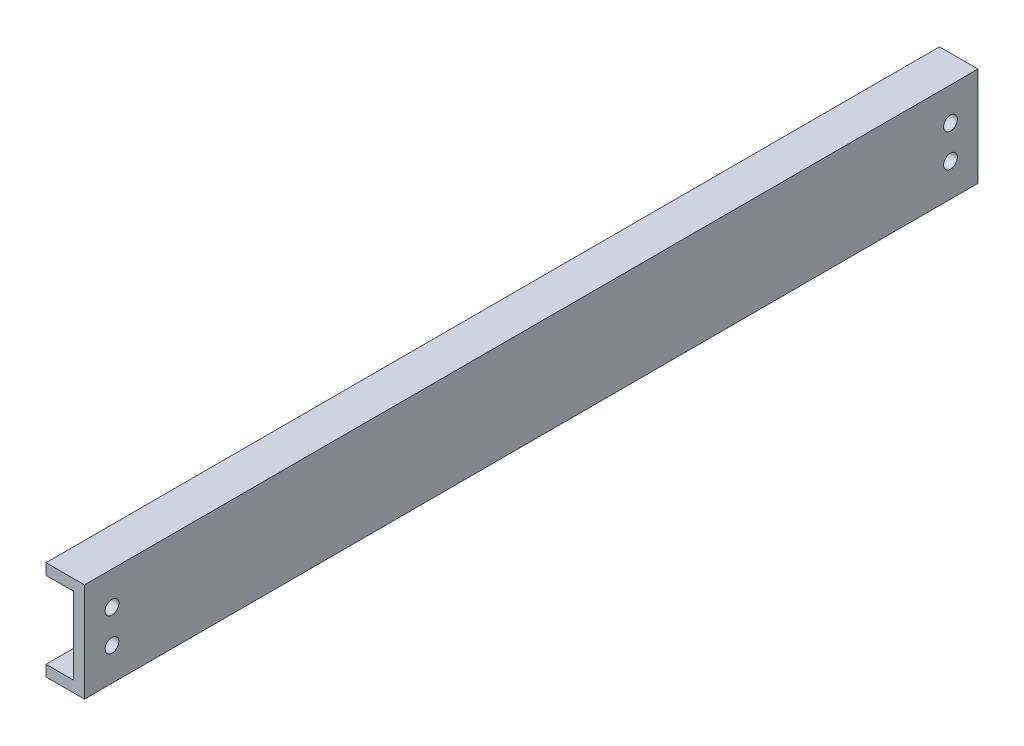
ISO-10303-21;
HEADER;
FILE_DESCRIPTION(('STEP AP214'),'2;1');
FILE_NAME('part.step','',(''),(''),'','','');
FILE_SCHEMA(('AUTOMOTIVE_DESIGN { 1 0 10303 214 1 1 1 1 }'));
ENDSEC;
DATA;
#1=APPLICATION_CONTEXT('core data for automotive mechanical design processes');
#2=APPLICATION_PROTOCOL_DEFINITION('international standard','automotive_design',2000,#1);
#3=PRODUCT_CONTEXT('',#1,'mechanical');
#4=PRODUCT('Part','Part','',(#3));
#5=PRODUCT_RELATED_PRODUCT_CATEGORY('part','',(#4));
#6=PRODUCT_DEFINITION_FORMATION('','',#4);
#7=PRODUCT_DEFINITION_CONTEXT('part definition',#1,'design');
#8=PRODUCT_DEFINITION('design','',#6,#7);
#9=PRODUCT_DEFINITION_SHAPE('','',#8);
#10=(LENGTH_UNIT() NAMED_UNIT(*) SI_UNIT(.MILLI.,.METRE.));
#11=(NAMED_UNIT(*) PLANE_ANGLE_UNIT() SI_UNIT($,.RADIAN.));
#12=(NAMED_UNIT(*) SI_UNIT($,.STERADIAN.) SOLID_ANGLE_UNIT());
#13=UNCERTAINTY_MEASURE_WITH_UNIT(LENGTH_MEASURE(1.E-05),#10,'distance_accuracy_value','');
#14=(GEOMETRIC_REPRESENTATION_CONTEXT(3) GLOBAL_UNCERTAINTY_ASSIGNED_CONTEXT((#13)) GLOBAL_UNIT_ASSIGNED_CONTEXT((#10,
#11,#12)) REPRESENTATION_CONTEXT('',''));
#15=CARTESIAN_POINT('',(0.,0.,0.));
#16=DIRECTION('',(0.,0.,1.));
#17=DIRECTION('',(1.,0.,0.));
#18=AXIS2_PLACEMENT_3D('',#15,#16,#17);
#19=CARTESIAN_POINT('',(-7.,9.88828278471343,-162.5));
#20=DIRECTION('',(-1.,0.,0.));
#21=DIRECTION('',(0.,0.,1.));
#22=AXIS2_PLACEMENT_3D('',#19,#20,#21);
#23=PLANE('',#22);
#24=DIRECTION('',(0.,-1.,0.));
#25=VECTOR('',#24,1.);
#26=CARTESIAN_POINT('',(-7.,9.88828278471343,0.));
#27=LINE('',#26,#25);
#28=CARTESIAN_POINT('',(-7.,9.88828278471343,0.));
#29=VERTEX_POINT('',#28);
#30=CARTESIAN_POINT('',(-7.,7.88828278471343,0.));
#31=VERTEX_POINT('',#30);
#32=EDGE_CURVE('E135',#29,#31,#27,.T.);
#33=ORIENTED_EDGE('',*,*,#32,.F.);
#34=DIRECTION('',(0.,0.,1.));
#35=VECTOR('',#34,1.);
#36=CARTESIAN_POINT('',(-7.,9.88828278471343,-162.5));
#37=LINE('',#36,#35);
#38=CARTESIAN_POINT('',(-7.,9.88828278471343,-162.5));
#39=VERTEX_POINT('',#38);
#40=EDGE_CURVE('E11',#39,#29,#37,.T.);
#41=ORIENTED_EDGE('',*,*,#40,.F.);
#42=DIRECTION('',(0.,-1.,0.));
#43=VECTOR('',#42,1.);
#44=CARTESIAN_POINT('',(-7.,9.88828278471343,-162.5));
#45=LINE('',#44,#43);
#46=CARTESIAN_POINT('',(-7.,7.88828278471343,-162.5));
#47=VERTEX_POINT('',#46);
#48=EDGE_CURVE('E155',#39,#47,#45,.T.);
#49=ORIENTED_EDGE('',*,*,#48,.T.);
#50=DIRECTION('',(0.,0.,1.));
#51=VECTOR('',#50,1.);
#52=CARTESIAN_POINT('',(-7.,7.88828278471343,-162.5));
#53=LINE('',#52,#51);
#54=EDGE_CURVE('E93',#47,#31,#53,.T.);
#55=ORIENTED_EDGE('',*,*,#54,.T.);
#56=EDGE_LOOP('',(#33,#41,#49,#55));
#57=FACE_BOUND('',#56,.T.);
#58=ADVANCED_FACE('F37',(#57),#23,.T.);
#59=CARTESIAN_POINT('',(-7.,9.88828278471343,-162.5));
#60=DIRECTION('',(0.,1.,0.));
#61=DIRECTION('',(-1.,0.,0.));
#62=AXIS2_PLACEMENT_3D('',#59,#60,#61);
#63=PLANE('',#62);
#64=DIRECTION('',(-1.,0.,0.));
#65=VECTOR('',#64,1.);
#66=CARTESIAN_POINT('',(-7.,9.88828278471343,0.));
#67=LINE('',#66,#65);
#68=CARTESIAN_POINT('',(0.,9.88828278471343,0.));
#69=VERTEX_POINT('',#68);
#70=EDGE_CURVE('E153',#69,#29,#67,.T.);
#71=ORIENTED_EDGE('',*,*,#70,.F.);
#72=DIRECTION('',(0.,0.,1.));
#73=VECTOR('',#72,1.);
#74=CARTESIAN_POINT('',(0.,9.88828278471343,-162.5));
#75=LINE('',#74,#73);
#76=CARTESIAN_POINT('',(0.,9.88828278471343,-162.5));
#77=VERTEX_POINT('',#76);
#78=EDGE_CURVE('E46',#77,#69,#75,.T.);
#79=ORIENTED_EDGE('',*,*,#78,.F.);
#80=DIRECTION('',(-1.,0.,0.));
#81=VECTOR('',#80,1.);
#82=CARTESIAN_POINT('',(-7.,9.88828278471343,-162.5));
#83=LINE('',#82,#81);
#84=EDGE_CURVE('E125',#77,#39,#83,.T.);
#85=ORIENTED_EDGE('',*,*,#84,.T.);
#86=ORIENTED_EDGE('',*,*,#40,.T.);
#87=EDGE_LOOP('',(#71,#79,#85,#86));
#88=FACE_BOUND('',#87,.T.);
#89=ADVANCED_FACE('F211',(#88),#63,.T.);
#90=CARTESIAN_POINT('',(0.,9.88828278471343,-162.5));
#91=DIRECTION('',(1.,0.,0.));
#92=DIRECTION('',(0.,1.,0.));
#93=AXIS2_PLACEMENT_3D('',#90,#91,#92);
#94=PLANE('',#93);
#95=CARTESIAN_POINT('',(0.,3.88828278471345,-157.5));
#96=DIRECTION('',(1.,0.,0.));
#97=DIRECTION('',(0.,-1.,0.));
#98=AXIS2_PLACEMENT_3D('',#95,#96,#97);
#99=CIRCLE('',#98,1.25000000000004);
#100=CARTESIAN_POINT('',(0.,2.63828278471341,-157.5));
#101=VERTEX_POINT('',#100);
#102=EDGE_CURVE('E259',#101,#101,#99,.T.);
#103=ORIENTED_EDGE('',*,*,#102,.F.);
#104=EDGE_LOOP('',(#103));
#105=FACE_BOUND('',#104,.T.);
#106=CARTESIAN_POINT('',(0.,-2.11171721528655,-157.5));
#107=DIRECTION('',(1.,0.,0.));
#108=DIRECTION('',(0.,1.,0.));
#109=AXIS2_PLACEMENT_3D('',#106,#107,#108);
#110=CIRCLE('',#109,1.25000000000004);
#111=CARTESIAN_POINT('',(0.,-0.861717215286511,-157.5));
#112=VERTEX_POINT('',#111);
#113=EDGE_CURVE('E255',#112,#112,#110,.T.);
#114=ORIENTED_EDGE('',*,*,#113,.F.);
#115=EDGE_LOOP('',(#114));
#116=FACE_BOUND('',#115,.T.);
#117=CARTESIAN_POINT('',(0.,-2.11171721528657,-5.));
#118=DIRECTION('',(1.,0.,0.));
#119=DIRECTION('',(0.,-1.,0.));
#120=AXIS2_PLACEMENT_3D('',#117,#118,#119);
#121=CIRCLE('',#120,1.25);
#122=CARTESIAN_POINT('',(0.,-3.36171721528657,-5.));
#123=VERTEX_POINT('',#122);
#124=EDGE_CURVE('E253',#123,#123,#121,.T.);
#125=ORIENTED_EDGE('',*,*,#124,.F.);
#126=EDGE_LOOP('',(#125));
#127=FACE_BOUND('',#126,.T.);
#128=CARTESIAN_POINT('',(0.,3.88828278471343,-5.));
#129=DIRECTION('',(1.,0.,0.));
#130=DIRECTION('',(0.,1.,0.));
#131=AXIS2_PLACEMENT_3D('',#128,#129,#130);
#132=CIRCLE('',#131,1.25);
#133=CARTESIAN_POINT('',(0.,5.13828278471343,-5.));
#134=VERTEX_POINT('',#133);
#135=EDGE_CURVE('E170',#134,#134,#132,.T.);
#136=ORIENTED_EDGE('',*,*,#135,.F.);
#137=EDGE_LOOP('',(#136));
#138=FACE_BOUND('',#137,.T.);
#139=DIRECTION('',(0.,1.,0.));
#140=VECTOR('',#139,1.);
#141=CARTESIAN_POINT('',(0.,9.88828278471343,0.));
#142=LINE('',#141,#140);
#143=CARTESIAN_POINT('',(0.,-8.11171721528657,0.));
#144=VERTEX_POINT('',#143);
#145=EDGE_CURVE('E112',#144,#69,#142,.T.);
#146=ORIENTED_EDGE('',*,*,#145,.F.);
#147=DIRECTION('',(0.,0.,1.));
#148=VECTOR('',#147,1.);
#149=CARTESIAN_POINT('',(0.,-8.11171721528657,-162.5));
#150=LINE('',#149,#148);
#151=CARTESIAN_POINT('',(0.,-8.11171721528657,-162.5));
#152=VERTEX_POINT('',#151);
#153=EDGE_CURVE('E107',#152,#144,#150,.T.);
#154=ORIENTED_EDGE('',*,*,#153,.F.);
#155=DIRECTION('',(0.,1.,0.));
#156=VECTOR('',#155,1.);
#157=CARTESIAN_POINT('',(0.,9.88828278471343,-162.5));
#158=LINE('',#157,#156);
#159=EDGE_CURVE('E110',#152,#77,#158,.T.);
#160=ORIENTED_EDGE('',*,*,#159,.T.);
#161=ORIENTED_EDGE('',*,*,#78,.T.);
#162=EDGE_LOOP('',(#146,#154,#160,#161));
#163=FACE_BOUND('',#162,.T.);
#164=ADVANCED_FACE('F109',(#105,#116,#127,#138,#163),#94,.T.);
#165=CARTESIAN_POINT('',(0.,-8.11171721528657,-162.5));
#166=DIRECTION('',(0.,-1.,0.));
#167=DIRECTION('',(1.,0.,0.));
#168=AXIS2_PLACEMENT_3D('',#165,#166,#167);
#169=PLANE('',#168);
#170=DIRECTION('',(1.,0.,0.));
#171=VECTOR('',#170,1.);
#172=CARTESIAN_POINT('',(0.,-8.11171721528657,0.));
#173=LINE('',#172,#171);
#174=CARTESIAN_POINT('',(-7.,-8.11171721528657,0.));
#175=VERTEX_POINT('',#174);
#176=EDGE_CURVE('E150',#175,#144,#173,.T.);
#177=ORIENTED_EDGE('',*,*,#176,.F.);
#178=DIRECTION('',(0.,0.,1.));
#179=VECTOR('',#178,1.);
#180=CARTESIAN_POINT('',(-7.,-8.11171721528657,-162.5));
#181=LINE('',#180,#179);
#182=CARTESIAN_POINT('',(-7.,-8.11171721528657,-162.5));
#183=VERTEX_POINT('',#182);
#184=EDGE_CURVE('E117',#183,#175,#181,.T.);
#185=ORIENTED_EDGE('',*,*,#184,.F.);
#186=DIRECTION('',(1.,0.,0.));
#187=VECTOR('',#186,1.);
#188=CARTESIAN_POINT('',(0.,-8.11171721528657,-162.5));
#189=LINE('',#188,#187);
#190=EDGE_CURVE('E123',#183,#152,#189,.T.);
#191=ORIENTED_EDGE('',*,*,#190,.T.);
#192=ORIENTED_EDGE('',*,*,#153,.T.);
#193=EDGE_LOOP('',(#177,#185,#191,#192));
#194=FACE_BOUND('',#193,.T.);
#195=ADVANCED_FACE('F127',(#194),#169,.T.);
#196=CARTESIAN_POINT('',(-7.,-8.11171721528657,-162.5));
#197=DIRECTION('',(-1.,0.,0.));
#198=DIRECTION('',(0.,0.,1.));
#199=AXIS2_PLACEMENT_3D('',#196,#197,#198);
#200=PLANE('',#199);
#201=DIRECTION('',(0.,-1.,0.));
#202=VECTOR('',#201,1.);
#203=CARTESIAN_POINT('',(-7.,-8.11171721528657,0.));
#204=LINE('',#203,#202);
#205=CARTESIAN_POINT('',(-7.,-6.11171721528657,0.));
#206=VERTEX_POINT('',#205);
#207=EDGE_CURVE('E147',#206,#175,#204,.T.);
#208=ORIENTED_EDGE('',*,*,#207,.F.);
#209=DIRECTION('',(0.,0.,1.));
#210=VECTOR('',#209,1.);
#211=CARTESIAN_POINT('',(-7.,-6.11171721528657,-162.5));
#212=LINE('',#211,#210);
#213=CARTESIAN_POINT('',(-7.,-6.11171721528657,-162.5));
#214=VERTEX_POINT('',#213);
#215=EDGE_CURVE('E159',#214,#206,#212,.T.);
#216=ORIENTED_EDGE('',*,*,#215,.F.);
#217=DIRECTION('',(0.,-1.,0.));
#218=VECTOR('',#217,1.);
#219=CARTESIAN_POINT('',(-7.,-8.11171721528657,-162.5));
#220=LINE('',#219,#218);
#221=EDGE_CURVE('E128',#214,#183,#220,.T.);
#222=ORIENTED_EDGE('',*,*,#221,.T.);
#223=ORIENTED_EDGE('',*,*,#184,.T.);
#224=EDGE_LOOP('',(#208,#216,#222,#223));
#225=FACE_BOUND('',#224,.T.);
#226=ADVANCED_FACE('F210',(#225),#200,.T.);
#227=CARTESIAN_POINT('',(-2.,-6.11171721528657,-162.5));
#228=DIRECTION('',(0.,1.,0.));
#229=DIRECTION('',(0.,0.,1.));
#230=AXIS2_PLACEMENT_3D('',#227,#228,#229);
#231=PLANE('',#230);
#232=DIRECTION('',(-1.,0.,0.));
#233=VECTOR('',#232,1.);
#234=CARTESIAN_POINT('',(-2.,-6.11171721528657,0.));
#235=LINE('',#234,#233);
#236=CARTESIAN_POINT('',(-2.,-6.11171721528657,0.));
#237=VERTEX_POINT('',#236);
#238=EDGE_CURVE('E144',#237,#206,#235,.T.);
#239=ORIENTED_EDGE('',*,*,#238,.F.);
#240=DIRECTION('',(0.,0.,1.));
#241=VECTOR('',#240,1.);
#242=CARTESIAN_POINT('',(-2.,-6.11171721528657,-162.5));
#243=LINE('',#242,#241);
#244=CARTESIAN_POINT('',(-2.,-6.11171721528657,-162.5));
#245=VERTEX_POINT('',#244);
#246=EDGE_CURVE('E161',#245,#237,#243,.T.);
#247=ORIENTED_EDGE('',*,*,#246,.F.);
#248=DIRECTION('',(-1.,0.,0.));
#249=VECTOR('',#248,1.);
#250=CARTESIAN_POINT('',(-2.,-6.11171721528657,-162.5));
#251=LINE('',#250,#249);
#252=EDGE_CURVE('E130',#245,#214,#251,.T.);
#253=ORIENTED_EDGE('',*,*,#252,.T.);
#254=ORIENTED_EDGE('',*,*,#215,.T.);
#255=EDGE_LOOP('',(#239,#247,#253,#254));
#256=FACE_BOUND('',#255,.T.);
#257=ADVANCED_FACE('F186',(#256),#231,.T.);
#258=CARTESIAN_POINT('',(-2.,7.88828278471343,-162.5));
#259=DIRECTION('',(-1.,0.,0.));
#260=DIRECTION('',(0.,-1.,0.));
#261=AXIS2_PLACEMENT_3D('',#258,#259,#260);
#262=PLANE('',#261);
#263=CARTESIAN_POINT('',(-2.,3.88828278471345,-157.5));
#264=DIRECTION('',(-1.,0.,0.));
#265=DIRECTION('',(0.,-1.,0.));
#266=AXIS2_PLACEMENT_3D('',#263,#264,#265);
#267=CIRCLE('',#266,1.25000000000004);
#268=CARTESIAN_POINT('',(-2.,2.63828278471341,-157.5));
#269=VERTEX_POINT('',#268);
#270=EDGE_CURVE('E40',#269,#269,#267,.T.);
#271=ORIENTED_EDGE('',*,*,#270,.F.);
#272=EDGE_LOOP('',(#271));
#273=FACE_BOUND('',#272,.T.);
#274=CARTESIAN_POINT('',(-2.,-2.11171721528655,-157.5));
#275=DIRECTION('',(-1.,0.,0.));
#276=DIRECTION('',(0.,-1.,0.));
#277=AXIS2_PLACEMENT_3D('',#274,#275,#276);
#278=CIRCLE('',#277,1.25000000000004);
#279=CARTESIAN_POINT('',(-2.,-3.36171721528659,-157.5));
#280=VERTEX_POINT('',#279);
#281=EDGE_CURVE('E172',#280,#280,#278,.T.);
#282=ORIENTED_EDGE('',*,*,#281,.F.);
#283=EDGE_LOOP('',(#282));
#284=FACE_BOUND('',#283,.T.);
#285=CARTESIAN_POINT('',(-2.,-2.11171721528657,-5.));
#286=DIRECTION('',(-1.,0.,0.));
#287=DIRECTION('',(0.,-1.,0.));
#288=AXIS2_PLACEMENT_3D('',#285,#286,#287);
#289=CIRCLE('',#288,1.25);
#290=CARTESIAN_POINT('',(-2.,-3.36171721528657,-5.));
#291=VERTEX_POINT('',#290);
#292=EDGE_CURVE('E169',#291,#291,#289,.T.);
#293=ORIENTED_EDGE('',*,*,#292,.F.);
#294=EDGE_LOOP('',(#293));
#295=FACE_BOUND('',#294,.T.);
#296=CARTESIAN_POINT('',(-2.,3.88828278471343,-5.));
#297=DIRECTION('',(-1.,0.,0.));
#298=DIRECTION('',(0.,-1.,0.));
#299=AXIS2_PLACEMENT_3D('',#296,#297,#298);
#300=CIRCLE('',#299,1.25);
#301=CARTESIAN_POINT('',(-2.,2.63828278471343,-5.));
#302=VERTEX_POINT('',#301);
#303=EDGE_CURVE('E166',#302,#302,#300,.T.);
#304=ORIENTED_EDGE('',*,*,#303,.F.);
#305=EDGE_LOOP('',(#304));
#306=FACE_BOUND('',#305,.T.);
#307=DIRECTION('',(0.,-1.,0.));
#308=VECTOR('',#307,1.);
#309=CARTESIAN_POINT('',(-2.,7.88828278471343,0.));
#310=LINE('',#309,#308);
#311=CARTESIAN_POINT('',(-2.,7.88828278471343,0.));
#312=VERTEX_POINT('',#311);
#313=EDGE_CURVE('E141',#312,#237,#310,.T.);
#314=ORIENTED_EDGE('',*,*,#313,.F.);
#315=DIRECTION('',(0.,0.,1.));
#316=VECTOR('',#315,1.);
#317=CARTESIAN_POINT('',(-2.,7.88828278471343,-162.5));
#318=LINE('',#317,#316);
#319=CARTESIAN_POINT('',(-2.,7.88828278471343,-162.5));
#320=VERTEX_POINT('',#319);
#321=EDGE_CURVE('E163',#320,#312,#318,.T.);
#322=ORIENTED_EDGE('',*,*,#321,.F.);
#323=DIRECTION('',(0.,-1.,0.));
#324=VECTOR('',#323,1.);
#325=CARTESIAN_POINT('',(-2.,7.88828278471343,-162.5));
#326=LINE('',#325,#324);
#327=EDGE_CURVE('E200',#320,#245,#326,.T.);
#328=ORIENTED_EDGE('',*,*,#327,.T.);
#329=ORIENTED_EDGE('',*,*,#246,.T.);
#330=EDGE_LOOP('',(#314,#322,#328,#329));
#331=FACE_BOUND('',#330,.T.);
#332=ADVANCED_FACE('F182',(#273,#284,#295,#306,#331),#262,.T.);
#333=CARTESIAN_POINT('',(-7.,7.88828278471343,-162.5));
#334=DIRECTION('',(0.,-1.,0.));
#335=DIRECTION('',(0.,0.,-1.));
#336=AXIS2_PLACEMENT_3D('',#333,#334,#335);
#337=PLANE('',#336);
#338=DIRECTION('',(1.,0.,0.));
#339=VECTOR('',#338,1.);
#340=CARTESIAN_POINT('',(-7.,7.88828278471343,0.));
#341=LINE('',#340,#339);
#342=EDGE_CURVE('E138',#31,#312,#341,.T.);
#343=ORIENTED_EDGE('',*,*,#342,.F.);
#344=ORIENTED_EDGE('',*,*,#54,.F.);
#345=DIRECTION('',(1.,0.,0.));
#346=VECTOR('',#345,1.);
#347=CARTESIAN_POINT('',(-7.,7.88828278471343,-162.5));
#348=LINE('',#347,#346);
#349=EDGE_CURVE('E199',#47,#320,#348,.T.);
#350=ORIENTED_EDGE('',*,*,#349,.T.);
#351=ORIENTED_EDGE('',*,*,#321,.T.);
#352=EDGE_LOOP('',(#343,#344,#350,#351));
#353=FACE_BOUND('',#352,.T.);
#354=ADVANCED_FACE('F185',(#353),#337,.T.);
#355=CARTESIAN_POINT('',(0.,0.,-162.5));
#356=DIRECTION('',(0.,0.,1.));
#357=DIRECTION('',(1.,0.,0.));
#358=AXIS2_PLACEMENT_3D('',#355,#356,#357);
#359=PLANE('',#358);
#360=ORIENTED_EDGE('',*,*,#48,.F.);
#361=ORIENTED_EDGE('',*,*,#84,.F.);
#362=ORIENTED_EDGE('',*,*,#159,.F.);
#363=ORIENTED_EDGE('',*,*,#190,.F.);
#364=ORIENTED_EDGE('',*,*,#221,.F.);
#365=ORIENTED_EDGE('',*,*,#252,.F.);
#366=ORIENTED_EDGE('',*,*,#327,.F.);
#367=ORIENTED_EDGE('',*,*,#349,.F.);
#368=EDGE_LOOP('',(#360,#361,#362,#363,#364,#365,#366,#367));
#369=FACE_BOUND('',#368,.T.);
#370=ADVANCED_FACE('F121',(#369),#359,.F.);
#371=CARTESIAN_POINT('',(0.,0.,0.));
#372=DIRECTION('',(0.,0.,1.));
#373=DIRECTION('',(1.,0.,0.));
#374=AXIS2_PLACEMENT_3D('',#371,#372,#373);
#375=PLANE('',#374);
#376=ORIENTED_EDGE('',*,*,#32,.T.);
#377=ORIENTED_EDGE('',*,*,#342,.T.);
#378=ORIENTED_EDGE('',*,*,#313,.T.);
#379=ORIENTED_EDGE('',*,*,#238,.T.);
#380=ORIENTED_EDGE('',*,*,#207,.T.);
#381=ORIENTED_EDGE('',*,*,#176,.T.);
#382=ORIENTED_EDGE('',*,*,#145,.T.);
#383=ORIENTED_EDGE('',*,*,#70,.T.);
#384=EDGE_LOOP('',(#376,#377,#378,#379,#380,#381,#382,#383));
#385=FACE_BOUND('',#384,.T.);
#386=ADVANCED_FACE('F198',(#385),#375,.T.);
#387=CARTESIAN_POINT('',(-7.,3.88828278471343,-5.));
#388=DIRECTION('',(1.,0.,0.));
#389=DIRECTION('',(0.,1.,0.));
#390=AXIS2_PLACEMENT_3D('',#387,#388,#389);
#391=CYLINDRICAL_SURFACE('',#390,1.25);
#392=ORIENTED_EDGE('',*,*,#303,.T.);
#393=EDGE_LOOP('',(#392));
#394=FACE_BOUND('',#393,.T.);
#395=ORIENTED_EDGE('',*,*,#135,.T.);
#396=EDGE_LOOP('',(#395));
#397=FACE_BOUND('',#396,.T.);
#398=ADVANCED_FACE('F235',(#394,#397),#391,.F.);
#399=CARTESIAN_POINT('',(-7.,-2.11171721528657,-5.));
#400=DIRECTION('',(1.,0.,0.));
#401=DIRECTION('',(0.,1.,0.));
#402=AXIS2_PLACEMENT_3D('',#399,#400,#401);
#403=CYLINDRICAL_SURFACE('',#402,1.25);
#404=ORIENTED_EDGE('',*,*,#292,.T.);
#405=EDGE_LOOP('',(#404));
#406=FACE_BOUND('',#405,.T.);
#407=ORIENTED_EDGE('',*,*,#124,.T.);
#408=EDGE_LOOP('',(#407));
#409=FACE_BOUND('',#408,.T.);
#410=ADVANCED_FACE('F239',(#406,#409),#403,.F.);
#411=CARTESIAN_POINT('',(-7.,-2.11171721528655,-157.5));
#412=DIRECTION('',(1.,0.,0.));
#413=DIRECTION('',(0.,1.,0.));
#414=AXIS2_PLACEMENT_3D('',#411,#412,#413);
#415=CYLINDRICAL_SURFACE('',#414,1.25000000000004);
#416=ORIENTED_EDGE('',*,*,#281,.T.);
#417=EDGE_LOOP('',(#416));
#418=FACE_BOUND('',#417,.T.);
#419=ORIENTED_EDGE('',*,*,#113,.T.);
#420=EDGE_LOOP('',(#419));
#421=FACE_BOUND('',#420,.T.);
#422=ADVANCED_FACE('F243',(#418,#421),#415,.F.);
#423=CARTESIAN_POINT('',(-7.,3.88828278471345,-157.5));
#424=DIRECTION('',(1.,0.,0.));
#425=DIRECTION('',(0.,1.,0.));
#426=AXIS2_PLACEMENT_3D('',#423,#424,#425);
#427=CYLINDRICAL_SURFACE('',#426,1.25000000000004);
#428=ORIENTED_EDGE('',*,*,#270,.T.);
#429=EDGE_LOOP('',(#428));
#430=FACE_BOUND('',#429,.T.);
#431=ORIENTED_EDGE('',*,*,#102,.T.);
#432=EDGE_LOOP('',(#431));
#433=FACE_BOUND('',#432,.T.);
#434=ADVANCED_FACE('F179',(#430,#433),#427,.F.);
#435=CLOSED_SHELL('',(#58,#89,#164,#195,#226,#257,#332,#354,#370,#386,#398,#410,#422,#434));
#436=MANIFOLD_SOLID_BREP('B2',#435);
#437=ADVANCED_BREP_SHAPE_REPRESENTATION('',(#18,#436),#14);
#438=SHAPE_DEFINITION_REPRESENTATION(#9,#437);
ENDSEC;
END-ISO-10303-21;
